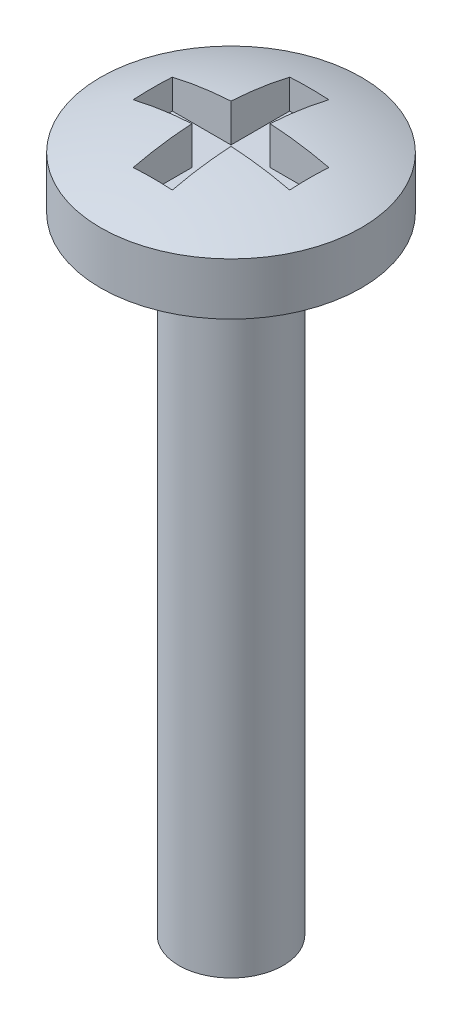
ISO-10303-21;
HEADER;
FILE_DESCRIPTION(('STEP AP214'),'2;1');
FILE_NAME('part.step','',(''),(''),'','','');
FILE_SCHEMA(('AUTOMOTIVE_DESIGN { 1 0 10303 214 1 1 1 1 }'));
ENDSEC;
DATA;
#1=APPLICATION_CONTEXT('core data for automotive mechanical design processes');
#2=APPLICATION_PROTOCOL_DEFINITION('international standard','automotive_design',2000,#1);
#3=PRODUCT_CONTEXT('',#1,'mechanical');
#4=PRODUCT('Part','Part','',(#3));
#5=PRODUCT_RELATED_PRODUCT_CATEGORY('part','',(#4));
#6=PRODUCT_DEFINITION_FORMATION('','',#4);
#7=PRODUCT_DEFINITION_CONTEXT('part definition',#1,'design');
#8=PRODUCT_DEFINITION('design','',#6,#7);
#9=PRODUCT_DEFINITION_SHAPE('','',#8);
#10=(LENGTH_UNIT() NAMED_UNIT(*) SI_UNIT(.MILLI.,.METRE.));
#11=(NAMED_UNIT(*) PLANE_ANGLE_UNIT() SI_UNIT($,.RADIAN.));
#12=(NAMED_UNIT(*) SI_UNIT($,.STERADIAN.) SOLID_ANGLE_UNIT());
#13=UNCERTAINTY_MEASURE_WITH_UNIT(LENGTH_MEASURE(1.E-05),#10,'distance_accuracy_value','');
#14=(GEOMETRIC_REPRESENTATION_CONTEXT(3) GLOBAL_UNCERTAINTY_ASSIGNED_CONTEXT((#13)) GLOBAL_UNIT_ASSIGNED_CONTEXT((#10,
#11,#12)) REPRESENTATION_CONTEXT('',''));
#15=CARTESIAN_POINT('',(0.,0.,0.));
#16=DIRECTION('',(0.,0.,1.));
#17=DIRECTION('',(1.,0.,0.));
#18=AXIS2_PLACEMENT_3D('',#15,#16,#17);
#19=CARTESIAN_POINT('',(0.,12.,0.));
#20=DIRECTION('',(0.,-1.,0.));
#21=DIRECTION('',(0.,0.,-1.));
#22=AXIS2_PLACEMENT_3D('',#19,#20,#21);
#23=CYLINDRICAL_SURFACE('',#22,1.);
#24=CARTESIAN_POINT('',(0.,12.,0.));
#25=DIRECTION('',(0.,1.,0.));
#26=DIRECTION('',(0.,0.,1.));
#27=AXIS2_PLACEMENT_3D('',#24,#25,#26);
#28=CIRCLE('',#27,1.);
#29=CARTESIAN_POINT('',(0.,12.,1.));
#30=VERTEX_POINT('',#29);
#31=EDGE_CURVE('E197',#30,#30,#28,.T.);
#32=ORIENTED_EDGE('',*,*,#31,.F.);
#33=EDGE_LOOP('',(#32));
#34=FACE_BOUND('',#33,.T.);
#35=CARTESIAN_POINT('',(0.,0.,0.));
#36=DIRECTION('',(0.,1.,0.));
#37=DIRECTION('',(0.,0.,1.));
#38=AXIS2_PLACEMENT_3D('',#35,#36,#37);
#39=CIRCLE('',#38,1.);
#40=CARTESIAN_POINT('',(0.,0.,1.));
#41=VERTEX_POINT('',#40);
#42=EDGE_CURVE('E201',#41,#41,#39,.T.);
#43=ORIENTED_EDGE('',*,*,#42,.T.);
#44=EDGE_LOOP('',(#43));
#45=FACE_BOUND('',#44,.T.);
#46=ADVANCED_FACE('F34',(#34,#45),#23,.T.);
#47=CARTESIAN_POINT('',(0.,0.,0.));
#48=DIRECTION('',(0.,1.,0.));
#49=DIRECTION('',(0.,0.,1.));
#50=AXIS2_PLACEMENT_3D('',#47,#48,#49);
#51=PLANE('',#50);
#52=ORIENTED_EDGE('',*,*,#42,.F.);
#53=EDGE_LOOP('',(#52));
#54=FACE_BOUND('',#53,.T.);
#55=ADVANCED_FACE('F275',(#54),#51,.F.);
#56=CARTESIAN_POINT('',(0.,13.,0.));
#57=DIRECTION('',(0.,-1.,0.));
#58=DIRECTION('',(0.,0.,-1.));
#59=AXIS2_PLACEMENT_3D('',#56,#57,#58);
#60=CYLINDRICAL_SURFACE('',#59,2.5);
#61=CARTESIAN_POINT('',(0.,13.,0.));
#62=DIRECTION('',(0.,1.,0.));
#63=DIRECTION('',(0.,0.,1.));
#64=AXIS2_PLACEMENT_3D('',#61,#62,#63);
#65=CIRCLE('',#64,2.5);
#66=CARTESIAN_POINT('',(0.,13.,2.5));
#67=VERTEX_POINT('',#66);
#68=EDGE_CURVE('E196',#67,#67,#65,.T.);
#69=ORIENTED_EDGE('',*,*,#68,.F.);
#70=EDGE_LOOP('',(#69));
#71=FACE_BOUND('',#70,.T.);
#72=CARTESIAN_POINT('',(0.,12.,0.));
#73=DIRECTION('',(0.,1.,0.));
#74=DIRECTION('',(0.,0.,1.));
#75=AXIS2_PLACEMENT_3D('',#72,#73,#74);
#76=CIRCLE('',#75,2.5);
#77=CARTESIAN_POINT('',(0.,12.,2.5));
#78=VERTEX_POINT('',#77);
#79=EDGE_CURVE('E166',#78,#78,#76,.T.);
#80=ORIENTED_EDGE('',*,*,#79,.T.);
#81=EDGE_LOOP('',(#80));
#82=FACE_BOUND('',#81,.T.);
#83=ADVANCED_FACE('F280',(#71,#82),#60,.T.);
#84=CARTESIAN_POINT('',(0.,7.00000000000001,0.));
#85=DIRECTION('',(0.,0.,1.));
#86=DIRECTION('',(1.,0.,0.));
#87=AXIS2_PLACEMENT_3D('',#84,#85,#86);
#88=SPHERICAL_SURFACE('',#87,6.49999999999999);
#89=CARTESIAN_POINT('',(0.,7.00000000000001,0.375));
#90=DIRECTION('',(0.,0.,1.));
#91=DIRECTION('',(1.,0.,0.));
#92=AXIS2_PLACEMENT_3D('',#89,#90,#91);
#93=CIRCLE('',#92,6.4891736762087);
#94=CARTESIAN_POINT('',(-1.5,13.3134281495872,0.375));
#95=VERTEX_POINT('',#94);
#96=CARTESIAN_POINT('',(-0.375,13.478329259925,0.375));
#97=VERTEX_POINT('',#96);
#98=EDGE_CURVE('E11',#95,#97,#93,.F.);
#99=ORIENTED_EDGE('',*,*,#98,.F.);
#100=CARTESIAN_POINT('',(-1.5,7.00000000000001,0.));
#101=DIRECTION('',(-1.,0.,0.));
#102=DIRECTION('',(0.,0.,1.));
#103=AXIS2_PLACEMENT_3D('',#100,#101,#102);
#104=CIRCLE('',#103,6.32455532033675);
#105=CARTESIAN_POINT('',(-1.5,13.3134281495872,-0.375));
#106=VERTEX_POINT('',#105);
#107=EDGE_CURVE('E42',#106,#95,#104,.F.);
#108=ORIENTED_EDGE('',*,*,#107,.F.);
#109=CARTESIAN_POINT('',(0.,7.00000000000001,-0.375));
#110=DIRECTION('',(0.,0.,1.));
#111=DIRECTION('',(1.,0.,0.));
#112=AXIS2_PLACEMENT_3D('',#109,#110,#111);
#113=CIRCLE('',#112,6.4891736762087);
#114=CARTESIAN_POINT('',(-0.375,13.478329259925,-0.375));
#115=VERTEX_POINT('',#114);
#116=EDGE_CURVE('E228',#106,#115,#113,.F.);
#117=ORIENTED_EDGE('',*,*,#116,.T.);
#118=CARTESIAN_POINT('',(-0.375,7.00000000000001,0.));
#119=DIRECTION('',(-1.,0.,0.));
#120=DIRECTION('',(0.,0.,1.));
#121=AXIS2_PLACEMENT_3D('',#118,#119,#120);
#122=CIRCLE('',#121,6.4891736762087);
#123=CARTESIAN_POINT('',(-0.375,13.3134281495872,-1.5));
#124=VERTEX_POINT('',#123);
#125=EDGE_CURVE('E226',#124,#115,#122,.F.);
#126=ORIENTED_EDGE('',*,*,#125,.F.);
#127=CARTESIAN_POINT('',(0.,7.00000000000001,-1.5));
#128=DIRECTION('',(0.,0.,1.));
#129=DIRECTION('',(1.,0.,0.));
#130=AXIS2_PLACEMENT_3D('',#127,#128,#129);
#131=CIRCLE('',#130,6.32455532033675);
#132=CARTESIAN_POINT('',(0.375,13.3134281495872,-1.5));
#133=VERTEX_POINT('',#132);
#134=EDGE_CURVE('E223',#124,#133,#131,.F.);
#135=ORIENTED_EDGE('',*,*,#134,.T.);
#136=CARTESIAN_POINT('',(0.375,7.00000000000001,0.));
#137=DIRECTION('',(-1.,0.,0.));
#138=DIRECTION('',(0.,0.,1.));
#139=AXIS2_PLACEMENT_3D('',#136,#137,#138);
#140=CIRCLE('',#139,6.4891736762087);
#141=CARTESIAN_POINT('',(0.375,13.478329259925,-0.375));
#142=VERTEX_POINT('',#141);
#143=EDGE_CURVE('E220',#133,#142,#140,.F.);
#144=ORIENTED_EDGE('',*,*,#143,.T.);
#145=CARTESIAN_POINT('',(0.,7.00000000000001,-0.375));
#146=DIRECTION('',(0.,0.,1.));
#147=DIRECTION('',(1.,0.,0.));
#148=AXIS2_PLACEMENT_3D('',#145,#146,#147);
#149=CIRCLE('',#148,6.4891736762087);
#150=CARTESIAN_POINT('',(1.5,13.3134281495872,-0.375));
#151=VERTEX_POINT('',#150);
#152=EDGE_CURVE('E217',#142,#151,#149,.F.);
#153=ORIENTED_EDGE('',*,*,#152,.T.);
#154=CARTESIAN_POINT('',(1.5,7.00000000000001,0.));
#155=DIRECTION('',(-1.,0.,0.));
#156=DIRECTION('',(0.,0.,1.));
#157=AXIS2_PLACEMENT_3D('',#154,#155,#156);
#158=CIRCLE('',#157,6.32455532033675);
#159=CARTESIAN_POINT('',(1.5,13.3134281495872,0.375));
#160=VERTEX_POINT('',#159);
#161=EDGE_CURVE('E214',#151,#160,#158,.F.);
#162=ORIENTED_EDGE('',*,*,#161,.T.);
#163=CARTESIAN_POINT('',(0.,7.00000000000001,0.375));
#164=DIRECTION('',(0.,0.,1.));
#165=DIRECTION('',(1.,0.,0.));
#166=AXIS2_PLACEMENT_3D('',#163,#164,#165);
#167=CIRCLE('',#166,6.4891736762087);
#168=CARTESIAN_POINT('',(0.375,13.478329259925,0.375));
#169=VERTEX_POINT('',#168);
#170=EDGE_CURVE('E212',#169,#160,#167,.F.);
#171=ORIENTED_EDGE('',*,*,#170,.F.);
#172=CARTESIAN_POINT('',(0.375,7.00000000000001,0.));
#173=DIRECTION('',(-1.,0.,0.));
#174=DIRECTION('',(0.,0.,1.));
#175=AXIS2_PLACEMENT_3D('',#172,#173,#174);
#176=CIRCLE('',#175,6.4891736762087);
#177=CARTESIAN_POINT('',(0.375,13.3134281495872,1.5));
#178=VERTEX_POINT('',#177);
#179=EDGE_CURVE('E209',#169,#178,#176,.F.);
#180=ORIENTED_EDGE('',*,*,#179,.T.);
#181=CARTESIAN_POINT('',(0.,7.00000000000001,1.5));
#182=DIRECTION('',(0.,0.,1.));
#183=DIRECTION('',(1.,0.,0.));
#184=AXIS2_PLACEMENT_3D('',#181,#182,#183);
#185=CIRCLE('',#184,6.32455532033675);
#186=CARTESIAN_POINT('',(-0.375,13.3134281495872,1.5));
#187=VERTEX_POINT('',#186);
#188=EDGE_CURVE('E207',#187,#178,#185,.F.);
#189=ORIENTED_EDGE('',*,*,#188,.F.);
#190=CARTESIAN_POINT('',(-0.375,7.00000000000001,0.));
#191=DIRECTION('',(-1.,0.,0.));
#192=DIRECTION('',(0.,0.,1.));
#193=AXIS2_PLACEMENT_3D('',#190,#191,#192);
#194=CIRCLE('',#193,6.4891736762087);
#195=EDGE_CURVE('E200',#97,#187,#194,.F.);
#196=ORIENTED_EDGE('',*,*,#195,.F.);
#197=EDGE_LOOP('',(#99,#108,#117,#126,#135,#144,#153,#162,#171,#180,#189,#196));
#198=FACE_BOUND('',#197,.T.);
#199=ORIENTED_EDGE('',*,*,#68,.T.);
#200=EDGE_LOOP('',(#199));
#201=FACE_BOUND('',#200,.T.);
#202=ADVANCED_FACE('F36',(#198,#201),#88,.T.);
#203=CARTESIAN_POINT('',(0.,12.,0.));
#204=DIRECTION('',(0.,1.,0.));
#205=DIRECTION('',(0.,0.,1.));
#206=AXIS2_PLACEMENT_3D('',#203,#204,#205);
#207=PLANE('',#206);
#208=ORIENTED_EDGE('',*,*,#31,.T.);
#209=EDGE_LOOP('',(#208));
#210=FACE_BOUND('',#209,.T.);
#211=ORIENTED_EDGE('',*,*,#79,.F.);
#212=EDGE_LOOP('',(#211));
#213=FACE_BOUND('',#212,.T.);
#214=ADVANCED_FACE('F289',(#210,#213),#207,.F.);
#215=CARTESIAN_POINT('',(0.,12.75,0.375));
#216=DIRECTION('',(0.,0.,1.));
#217=DIRECTION('',(1.,0.,0.));
#218=AXIS2_PLACEMENT_3D('',#215,#216,#217);
#219=PLANE('',#218);
#220=ORIENTED_EDGE('',*,*,#98,.T.);
#221=DIRECTION('',(0.,1.,0.));
#222=VECTOR('',#221,1.);
#223=CARTESIAN_POINT('',(-0.375,12.75,0.375));
#224=LINE('',#223,#222);
#225=CARTESIAN_POINT('',(-0.375,12.75,0.375));
#226=VERTEX_POINT('',#225);
#227=EDGE_CURVE('E49',#226,#97,#224,.T.);
#228=ORIENTED_EDGE('',*,*,#227,.F.);
#229=DIRECTION('',(1.,0.,0.));
#230=VECTOR('',#229,1.);
#231=CARTESIAN_POINT('',(0.,12.75,0.375));
#232=LINE('',#231,#230);
#233=CARTESIAN_POINT('',(-1.5,12.75,0.375));
#234=VERTEX_POINT('',#233);
#235=EDGE_CURVE('E123',#234,#226,#232,.T.);
#236=ORIENTED_EDGE('',*,*,#235,.F.);
#237=DIRECTION('',(0.,1.,0.));
#238=VECTOR('',#237,1.);
#239=CARTESIAN_POINT('',(-1.5,12.75,0.375));
#240=LINE('',#239,#238);
#241=EDGE_CURVE('E164',#234,#95,#240,.T.);
#242=ORIENTED_EDGE('',*,*,#241,.T.);
#243=EDGE_LOOP('',(#220,#228,#236,#242));
#244=FACE_BOUND('',#243,.T.);
#245=ADVANCED_FACE('F121',(#244),#219,.F.);
#246=CARTESIAN_POINT('',(-1.5,12.75,0.));
#247=DIRECTION('',(-1.,0.,0.));
#248=DIRECTION('',(0.,0.,1.));
#249=AXIS2_PLACEMENT_3D('',#246,#247,#248);
#250=PLANE('',#249);
#251=ORIENTED_EDGE('',*,*,#107,.T.);
#252=ORIENTED_EDGE('',*,*,#241,.F.);
#253=DIRECTION('',(0.,0.,1.));
#254=VECTOR('',#253,1.);
#255=CARTESIAN_POINT('',(-1.5,12.75,0.));
#256=LINE('',#255,#254);
#257=CARTESIAN_POINT('',(-1.5,12.75,-0.375));
#258=VERTEX_POINT('',#257);
#259=EDGE_CURVE('E128',#258,#234,#256,.T.);
#260=ORIENTED_EDGE('',*,*,#259,.F.);
#261=DIRECTION('',(0.,1.,0.));
#262=VECTOR('',#261,1.);
#263=CARTESIAN_POINT('',(-1.5,12.75,-0.375));
#264=LINE('',#263,#262);
#265=EDGE_CURVE('E167',#258,#106,#264,.T.);
#266=ORIENTED_EDGE('',*,*,#265,.T.);
#267=EDGE_LOOP('',(#251,#252,#260,#266));
#268=FACE_BOUND('',#267,.T.);
#269=ADVANCED_FACE('F236',(#268),#250,.F.);
#270=CARTESIAN_POINT('',(0.,12.75,-0.375));
#271=DIRECTION('',(0.,0.,1.));
#272=DIRECTION('',(1.,0.,0.));
#273=AXIS2_PLACEMENT_3D('',#270,#271,#272);
#274=PLANE('',#273);
#275=ORIENTED_EDGE('',*,*,#265,.F.);
#276=DIRECTION('',(1.,0.,0.));
#277=VECTOR('',#276,1.);
#278=CARTESIAN_POINT('',(0.,12.75,-0.375));
#279=LINE('',#278,#277);
#280=CARTESIAN_POINT('',(-0.375,12.75,-0.375));
#281=VERTEX_POINT('',#280);
#282=EDGE_CURVE('E161',#258,#281,#279,.T.);
#283=ORIENTED_EDGE('',*,*,#282,.T.);
#284=DIRECTION('',(0.,1.,0.));
#285=VECTOR('',#284,1.);
#286=CARTESIAN_POINT('',(-0.375,12.75,-0.375));
#287=LINE('',#286,#285);
#288=EDGE_CURVE('E169',#281,#115,#287,.T.);
#289=ORIENTED_EDGE('',*,*,#288,.T.);
#290=ORIENTED_EDGE('',*,*,#116,.F.);
#291=EDGE_LOOP('',(#275,#283,#289,#290));
#292=FACE_BOUND('',#291,.T.);
#293=ADVANCED_FACE('F234',(#292),#274,.T.);
#294=CARTESIAN_POINT('',(-0.375,12.75,0.));
#295=DIRECTION('',(-1.,0.,0.));
#296=DIRECTION('',(0.,0.,1.));
#297=AXIS2_PLACEMENT_3D('',#294,#295,#296);
#298=PLANE('',#297);
#299=ORIENTED_EDGE('',*,*,#125,.T.);
#300=ORIENTED_EDGE('',*,*,#288,.F.);
#301=DIRECTION('',(0.,0.,1.));
#302=VECTOR('',#301,1.);
#303=CARTESIAN_POINT('',(-0.375,12.75,0.));
#304=LINE('',#303,#302);
#305=CARTESIAN_POINT('',(-0.375,12.75,-1.5));
#306=VERTEX_POINT('',#305);
#307=EDGE_CURVE('E158',#306,#281,#304,.T.);
#308=ORIENTED_EDGE('',*,*,#307,.F.);
#309=DIRECTION('',(0.,1.,0.));
#310=VECTOR('',#309,1.);
#311=CARTESIAN_POINT('',(-0.375,12.75,-1.5));
#312=LINE('',#311,#310);
#313=EDGE_CURVE('E172',#306,#124,#312,.T.);
#314=ORIENTED_EDGE('',*,*,#313,.T.);
#315=EDGE_LOOP('',(#299,#300,#308,#314));
#316=FACE_BOUND('',#315,.T.);
#317=ADVANCED_FACE('F264',(#316),#298,.F.);
#318=CARTESIAN_POINT('',(0.,12.75,-1.5));
#319=DIRECTION('',(0.,0.,1.));
#320=DIRECTION('',(1.,0.,0.));
#321=AXIS2_PLACEMENT_3D('',#318,#319,#320);
#322=PLANE('',#321);
#323=ORIENTED_EDGE('',*,*,#313,.F.);
#324=DIRECTION('',(1.,0.,0.));
#325=VECTOR('',#324,1.);
#326=CARTESIAN_POINT('',(0.,12.75,-1.5));
#327=LINE('',#326,#325);
#328=CARTESIAN_POINT('',(0.375,12.75,-1.5));
#329=VERTEX_POINT('',#328);
#330=EDGE_CURVE('E156',#306,#329,#327,.T.);
#331=ORIENTED_EDGE('',*,*,#330,.T.);
#332=DIRECTION('',(0.,1.,0.));
#333=VECTOR('',#332,1.);
#334=CARTESIAN_POINT('',(0.375,12.75,-1.5));
#335=LINE('',#334,#333);
#336=EDGE_CURVE('E175',#329,#133,#335,.T.);
#337=ORIENTED_EDGE('',*,*,#336,.T.);
#338=ORIENTED_EDGE('',*,*,#134,.F.);
#339=EDGE_LOOP('',(#323,#331,#337,#338));
#340=FACE_BOUND('',#339,.T.);
#341=ADVANCED_FACE('F265',(#340),#322,.T.);
#342=CARTESIAN_POINT('',(0.375,12.75,0.));
#343=DIRECTION('',(-1.,0.,0.));
#344=DIRECTION('',(0.,0.,1.));
#345=AXIS2_PLACEMENT_3D('',#342,#343,#344);
#346=PLANE('',#345);
#347=ORIENTED_EDGE('',*,*,#336,.F.);
#348=DIRECTION('',(0.,0.,1.));
#349=VECTOR('',#348,1.);
#350=CARTESIAN_POINT('',(0.375,12.75,0.));
#351=LINE('',#350,#349);
#352=CARTESIAN_POINT('',(0.375,12.75,-0.375));
#353=VERTEX_POINT('',#352);
#354=EDGE_CURVE('E154',#329,#353,#351,.T.);
#355=ORIENTED_EDGE('',*,*,#354,.T.);
#356=DIRECTION('',(0.,1.,0.));
#357=VECTOR('',#356,1.);
#358=CARTESIAN_POINT('',(0.375,12.75,-0.375));
#359=LINE('',#358,#357);
#360=EDGE_CURVE('E178',#353,#142,#359,.T.);
#361=ORIENTED_EDGE('',*,*,#360,.T.);
#362=ORIENTED_EDGE('',*,*,#143,.F.);
#363=EDGE_LOOP('',(#347,#355,#361,#362));
#364=FACE_BOUND('',#363,.T.);
#365=ADVANCED_FACE('F258',(#364),#346,.T.);
#366=CARTESIAN_POINT('',(0.,12.75,-0.375));
#367=DIRECTION('',(0.,0.,1.));
#368=DIRECTION('',(1.,0.,0.));
#369=AXIS2_PLACEMENT_3D('',#366,#367,#368);
#370=PLANE('',#369);
#371=ORIENTED_EDGE('',*,*,#360,.F.);
#372=DIRECTION('',(1.,0.,0.));
#373=VECTOR('',#372,1.);
#374=CARTESIAN_POINT('',(0.,12.75,-0.375));
#375=LINE('',#374,#373);
#376=CARTESIAN_POINT('',(1.5,12.75,-0.375));
#377=VERTEX_POINT('',#376);
#378=EDGE_CURVE('E152',#353,#377,#375,.T.);
#379=ORIENTED_EDGE('',*,*,#378,.T.);
#380=DIRECTION('',(0.,1.,0.));
#381=VECTOR('',#380,1.);
#382=CARTESIAN_POINT('',(1.5,12.75,-0.375));
#383=LINE('',#382,#381);
#384=EDGE_CURVE('E181',#377,#151,#383,.T.);
#385=ORIENTED_EDGE('',*,*,#384,.T.);
#386=ORIENTED_EDGE('',*,*,#152,.F.);
#387=EDGE_LOOP('',(#371,#379,#385,#386));
#388=FACE_BOUND('',#387,.T.);
#389=ADVANCED_FACE('F254',(#388),#370,.T.);
#390=CARTESIAN_POINT('',(1.5,12.75,0.));
#391=DIRECTION('',(-1.,0.,0.));
#392=DIRECTION('',(0.,0.,1.));
#393=AXIS2_PLACEMENT_3D('',#390,#391,#392);
#394=PLANE('',#393);
#395=ORIENTED_EDGE('',*,*,#384,.F.);
#396=DIRECTION('',(0.,0.,1.));
#397=VECTOR('',#396,1.);
#398=CARTESIAN_POINT('',(1.5,12.75,0.));
#399=LINE('',#398,#397);
#400=CARTESIAN_POINT('',(1.5,12.75,0.375));
#401=VERTEX_POINT('',#400);
#402=EDGE_CURVE('E150',#377,#401,#399,.T.);
#403=ORIENTED_EDGE('',*,*,#402,.T.);
#404=DIRECTION('',(0.,1.,0.));
#405=VECTOR('',#404,1.);
#406=CARTESIAN_POINT('',(1.5,12.75,0.375));
#407=LINE('',#406,#405);
#408=EDGE_CURVE('E184',#401,#160,#407,.T.);
#409=ORIENTED_EDGE('',*,*,#408,.T.);
#410=ORIENTED_EDGE('',*,*,#161,.F.);
#411=EDGE_LOOP('',(#395,#403,#409,#410));
#412=FACE_BOUND('',#411,.T.);
#413=ADVANCED_FACE('F251',(#412),#394,.T.);
#414=CARTESIAN_POINT('',(0.,12.75,0.375));
#415=DIRECTION('',(0.,0.,1.));
#416=DIRECTION('',(1.,0.,0.));
#417=AXIS2_PLACEMENT_3D('',#414,#415,#416);
#418=PLANE('',#417);
#419=ORIENTED_EDGE('',*,*,#170,.T.);
#420=ORIENTED_EDGE('',*,*,#408,.F.);
#421=DIRECTION('',(1.,0.,0.));
#422=VECTOR('',#421,1.);
#423=CARTESIAN_POINT('',(0.,12.75,0.375));
#424=LINE('',#423,#422);
#425=CARTESIAN_POINT('',(0.375,12.75,0.375));
#426=VERTEX_POINT('',#425);
#427=EDGE_CURVE('E147',#426,#401,#424,.T.);
#428=ORIENTED_EDGE('',*,*,#427,.F.);
#429=DIRECTION('',(0.,1.,0.));
#430=VECTOR('',#429,1.);
#431=CARTESIAN_POINT('',(0.375,12.75,0.375));
#432=LINE('',#431,#430);
#433=EDGE_CURVE('E187',#426,#169,#432,.T.);
#434=ORIENTED_EDGE('',*,*,#433,.T.);
#435=EDGE_LOOP('',(#419,#420,#428,#434));
#436=FACE_BOUND('',#435,.T.);
#437=ADVANCED_FACE('F247',(#436),#418,.F.);
#438=CARTESIAN_POINT('',(0.375,12.75,0.));
#439=DIRECTION('',(-1.,0.,0.));
#440=DIRECTION('',(0.,0.,1.));
#441=AXIS2_PLACEMENT_3D('',#438,#439,#440);
#442=PLANE('',#441);
#443=ORIENTED_EDGE('',*,*,#433,.F.);
#444=DIRECTION('',(0.,0.,1.));
#445=VECTOR('',#444,1.);
#446=CARTESIAN_POINT('',(0.375,12.75,0.));
#447=LINE('',#446,#445);
#448=CARTESIAN_POINT('',(0.375,12.75,1.5));
#449=VERTEX_POINT('',#448);
#450=EDGE_CURVE('E145',#426,#449,#447,.T.);
#451=ORIENTED_EDGE('',*,*,#450,.T.);
#452=DIRECTION('',(0.,1.,0.));
#453=VECTOR('',#452,1.);
#454=CARTESIAN_POINT('',(0.375,12.75,1.5));
#455=LINE('',#454,#453);
#456=EDGE_CURVE('E190',#449,#178,#455,.T.);
#457=ORIENTED_EDGE('',*,*,#456,.T.);
#458=ORIENTED_EDGE('',*,*,#179,.F.);
#459=EDGE_LOOP('',(#443,#451,#457,#458));
#460=FACE_BOUND('',#459,.T.);
#461=ADVANCED_FACE('F299',(#460),#442,.T.);
#462=CARTESIAN_POINT('',(0.,12.75,1.5));
#463=DIRECTION('',(0.,0.,1.));
#464=DIRECTION('',(1.,0.,0.));
#465=AXIS2_PLACEMENT_3D('',#462,#463,#464);
#466=PLANE('',#465);
#467=ORIENTED_EDGE('',*,*,#188,.T.);
#468=ORIENTED_EDGE('',*,*,#456,.F.);
#469=DIRECTION('',(1.,0.,0.));
#470=VECTOR('',#469,1.);
#471=CARTESIAN_POINT('',(0.,12.75,1.5));
#472=LINE('',#471,#470);
#473=CARTESIAN_POINT('',(-0.375,12.75,1.5));
#474=VERTEX_POINT('',#473);
#475=EDGE_CURVE('E137',#474,#449,#472,.T.);
#476=ORIENTED_EDGE('',*,*,#475,.F.);
#477=DIRECTION('',(0.,1.,0.));
#478=VECTOR('',#477,1.);
#479=CARTESIAN_POINT('',(-0.375,12.75,1.5));
#480=LINE('',#479,#478);
#481=EDGE_CURVE('E127',#474,#187,#480,.T.);
#482=ORIENTED_EDGE('',*,*,#481,.T.);
#483=EDGE_LOOP('',(#467,#468,#476,#482));
#484=FACE_BOUND('',#483,.T.);
#485=ADVANCED_FACE('F239',(#484),#466,.F.);
#486=CARTESIAN_POINT('',(-0.375,12.75,0.));
#487=DIRECTION('',(-1.,0.,0.));
#488=DIRECTION('',(0.,0.,1.));
#489=AXIS2_PLACEMENT_3D('',#486,#487,#488);
#490=PLANE('',#489);
#491=ORIENTED_EDGE('',*,*,#195,.T.);
#492=ORIENTED_EDGE('',*,*,#481,.F.);
#493=DIRECTION('',(0.,0.,1.));
#494=VECTOR('',#493,1.);
#495=CARTESIAN_POINT('',(-0.375,12.75,0.));
#496=LINE('',#495,#494);
#497=EDGE_CURVE('E131',#226,#474,#496,.T.);
#498=ORIENTED_EDGE('',*,*,#497,.F.);
#499=ORIENTED_EDGE('',*,*,#227,.T.);
#500=EDGE_LOOP('',(#491,#492,#498,#499));
#501=FACE_BOUND('',#500,.T.);
#502=ADVANCED_FACE('F132',(#501),#490,.F.);
#503=CARTESIAN_POINT('',(0.,12.75,0.));
#504=DIRECTION('',(0.,1.,0.));
#505=DIRECTION('',(0.,0.,1.));
#506=AXIS2_PLACEMENT_3D('',#503,#504,#505);
#507=PLANE('',#506);
#508=ORIENTED_EDGE('',*,*,#235,.T.);
#509=ORIENTED_EDGE('',*,*,#497,.T.);
#510=ORIENTED_EDGE('',*,*,#475,.T.);
#511=ORIENTED_EDGE('',*,*,#450,.F.);
#512=ORIENTED_EDGE('',*,*,#427,.T.);
#513=ORIENTED_EDGE('',*,*,#402,.F.);
#514=ORIENTED_EDGE('',*,*,#378,.F.);
#515=ORIENTED_EDGE('',*,*,#354,.F.);
#516=ORIENTED_EDGE('',*,*,#330,.F.);
#517=ORIENTED_EDGE('',*,*,#307,.T.);
#518=ORIENTED_EDGE('',*,*,#282,.F.);
#519=ORIENTED_EDGE('',*,*,#259,.T.);
#520=EDGE_LOOP('',(#508,#509,#510,#511,#512,#513,#514,#515,#516,#517,#518,#519));
#521=FACE_BOUND('',#520,.T.);
#522=ADVANCED_FACE('F139',(#521),#507,.T.);
#523=CLOSED_SHELL('',(#46,#55,#83,#202,#214,#245,#269,#293,#317,#341,#365,#389,#413,#437,#461,
#485,#502,#522));
#524=MANIFOLD_SOLID_BREP('B2',#523);
#525=ADVANCED_BREP_SHAPE_REPRESENTATION('',(#18,#524),#14);
#526=SHAPE_DEFINITION_REPRESENTATION(#9,#525);
ENDSEC;
END-ISO-10303-21;
